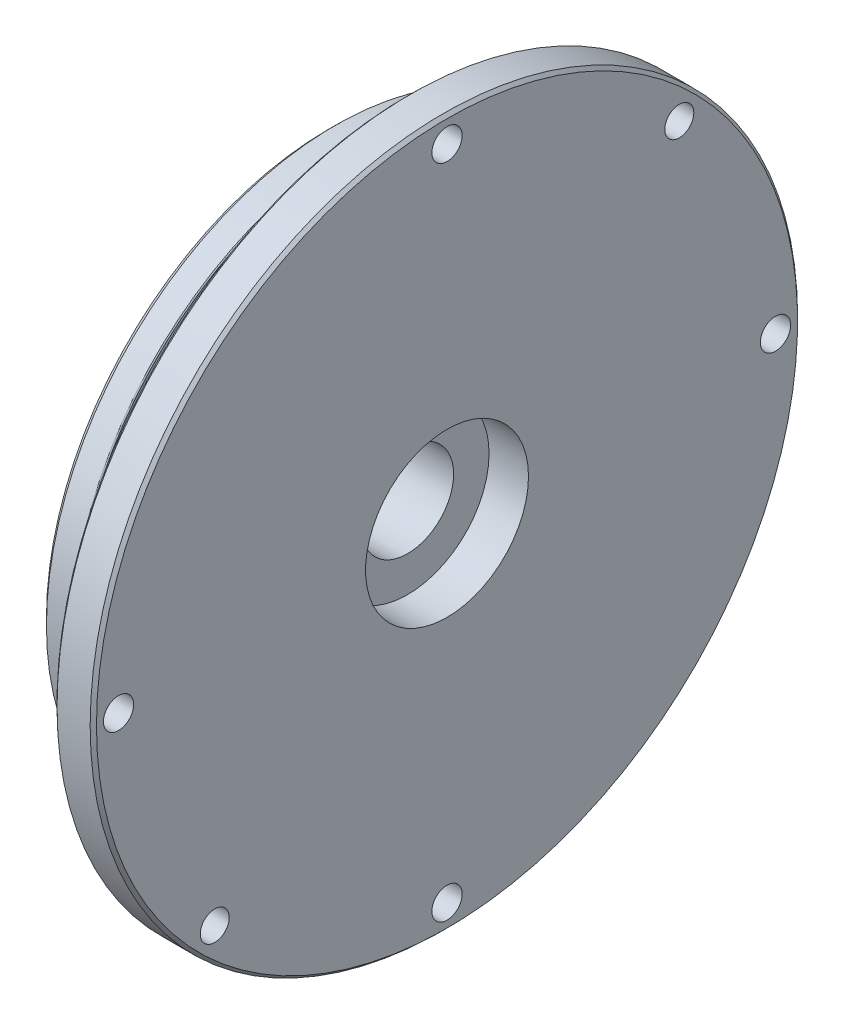
ISO-10303-21;
HEADER;
FILE_DESCRIPTION(('STEP AP214'),'2;1');
FILE_NAME('part.step','',(''),(''),'','','');
FILE_SCHEMA(('AUTOMOTIVE_DESIGN { 1 0 10303 214 1 1 1 1 }'));
ENDSEC;
DATA;
#1=APPLICATION_CONTEXT('core data for automotive mechanical design processes');
#2=APPLICATION_PROTOCOL_DEFINITION('international standard','automotive_design',2000,#1);
#3=PRODUCT_CONTEXT('',#1,'mechanical');
#4=PRODUCT('Part','Part','',(#3));
#5=PRODUCT_RELATED_PRODUCT_CATEGORY('part','',(#4));
#6=PRODUCT_DEFINITION_FORMATION('','',#4);
#7=PRODUCT_DEFINITION_CONTEXT('part definition',#1,'design');
#8=PRODUCT_DEFINITION('design','',#6,#7);
#9=PRODUCT_DEFINITION_SHAPE('','',#8);
#10=(LENGTH_UNIT() NAMED_UNIT(*) SI_UNIT(.MILLI.,.METRE.));
#11=(NAMED_UNIT(*) PLANE_ANGLE_UNIT() SI_UNIT($,.RADIAN.));
#12=(NAMED_UNIT(*) SI_UNIT($,.STERADIAN.) SOLID_ANGLE_UNIT());
#13=UNCERTAINTY_MEASURE_WITH_UNIT(LENGTH_MEASURE(1.E-05),#10,'distance_accuracy_value','');
#14=(GEOMETRIC_REPRESENTATION_CONTEXT(3) GLOBAL_UNCERTAINTY_ASSIGNED_CONTEXT((#13)) GLOBAL_UNIT_ASSIGNED_CONTEXT((#10,
#11,#12)) REPRESENTATION_CONTEXT('',''));
#15=CARTESIAN_POINT('',(0.,0.,0.));
#16=DIRECTION('',(0.,0.,1.));
#17=DIRECTION('',(1.,0.,0.));
#18=AXIS2_PLACEMENT_3D('',#15,#16,#17);
#19=CARTESIAN_POINT('',(3.937,0.,34.8996));
#20=DIRECTION('',(1.,0.,0.));
#21=DIRECTION('',(0.,0.,-1.));
#22=AXIS2_PLACEMENT_3D('',#19,#20,#21);
#23=PLANE('',#22);
#24=CARTESIAN_POINT('',(3.937,0.,0.));
#25=DIRECTION('',(1.,0.,0.));
#26=DIRECTION('',(0.,0.,1.));
#27=AXIS2_PLACEMENT_3D('',#24,#25,#26);
#28=CIRCLE('',#27,34.036);
#29=CARTESIAN_POINT('',(3.937,0.,-34.036));
#30=VERTEX_POINT('',#29);
#31=CARTESIAN_POINT('',(3.937,0.,34.036));
#32=VERTEX_POINT('',#31);
#33=EDGE_CURVE('E60',#30,#32,#28,.F.);
#34=ORIENTED_EDGE('',*,*,#33,.T.);
#35=CARTESIAN_POINT('',(3.937,0.,0.));
#36=DIRECTION('',(1.,0.,0.));
#37=DIRECTION('',(0.,0.,-1.));
#38=AXIS2_PLACEMENT_3D('',#35,#36,#37);
#39=CIRCLE('',#38,34.036);
#40=EDGE_CURVE('E63',#32,#30,#39,.F.);
#41=ORIENTED_EDGE('',*,*,#40,.T.);
#42=EDGE_LOOP('',(#34,#41));
#43=FACE_BOUND('',#42,.T.);
#44=CARTESIAN_POINT('',(3.937,0.,0.));
#45=DIRECTION('',(-1.,0.,0.));
#46=DIRECTION('',(0.,0.,1.));
#47=AXIS2_PLACEMENT_3D('',#44,#45,#46);
#48=CIRCLE('',#47,34.7726);
#49=CARTESIAN_POINT('',(3.937,0.,34.7726));
#50=VERTEX_POINT('',#49);
#51=CARTESIAN_POINT('',(3.937,0.,-34.7726));
#52=VERTEX_POINT('',#51);
#53=EDGE_CURVE('E107',#50,#52,#48,.T.);
#54=ORIENTED_EDGE('',*,*,#53,.F.);
#55=CARTESIAN_POINT('',(3.937,0.,0.));
#56=DIRECTION('',(-1.,0.,0.));
#57=DIRECTION('',(0.,0.,-1.));
#58=AXIS2_PLACEMENT_3D('',#55,#56,#57);
#59=CIRCLE('',#58,34.7726);
#60=EDGE_CURVE('E69',#52,#50,#59,.T.);
#61=ORIENTED_EDGE('',*,*,#60,.F.);
#62=EDGE_LOOP('',(#54,#61));
#63=FACE_BOUND('',#62,.T.);
#64=ADVANCED_FACE('F19',(#43,#63),#23,.T.);
#65=CARTESIAN_POINT('',(4.318,0.,0.));
#66=DIRECTION('',(1.,0.,0.));
#67=DIRECTION('',(0.,0.,-1.));
#68=AXIS2_PLACEMENT_3D('',#65,#66,#67);
#69=TOROIDAL_SURFACE('',#68,34.036,0.381);
#70=CARTESIAN_POINT('',(4.318,0.,0.));
#71=DIRECTION('',(-1.,0.,0.));
#72=DIRECTION('',(0.,0.,1.));
#73=AXIS2_PLACEMENT_3D('',#70,#71,#72);
#74=CIRCLE('',#73,33.655);
#75=CARTESIAN_POINT('',(4.318,0.,33.655));
#76=VERTEX_POINT('',#75);
#77=EDGE_CURVE('E104',#76,#76,#74,.F.);
#78=ORIENTED_EDGE('',*,*,#77,.F.);
#79=EDGE_LOOP('',(#78));
#80=FACE_BOUND('',#79,.T.);
#81=ORIENTED_EDGE('',*,*,#33,.F.);
#82=ORIENTED_EDGE('',*,*,#40,.F.);
#83=EDGE_LOOP('',(#81,#82));
#84=FACE_BOUND('',#83,.T.);
#85=ADVANCED_FACE('F72',(#80,#84),#69,.F.);
#86=CARTESIAN_POINT('',(3.81,0.,0.));
#87=DIRECTION('',(1.,0.,0.));
#88=DIRECTION('',(0.,0.,-1.));
#89=AXIS2_PLACEMENT_3D('',#86,#87,#88);
#90=TOROIDAL_SURFACE('',#89,34.7726,0.127);
#91=ORIENTED_EDGE('',*,*,#60,.T.);
#92=ORIENTED_EDGE('',*,*,#53,.T.);
#93=EDGE_LOOP('',(#91,#92));
#94=FACE_BOUND('',#93,.T.);
#95=CARTESIAN_POINT('',(3.81,0.,0.));
#96=DIRECTION('',(-1.,0.,0.));
#97=DIRECTION('',(0.,0.,1.));
#98=AXIS2_PLACEMENT_3D('',#95,#96,#97);
#99=CIRCLE('',#98,34.8996);
#100=CARTESIAN_POINT('',(3.81,0.,34.8996));
#101=VERTEX_POINT('',#100);
#102=EDGE_CURVE('E101',#101,#101,#99,.T.);
#103=ORIENTED_EDGE('',*,*,#102,.F.);
#104=EDGE_LOOP('',(#103));
#105=FACE_BOUND('',#104,.T.);
#106=ADVANCED_FACE('F81',(#94,#105),#90,.T.);
#107=CARTESIAN_POINT('',(0.,0.,0.));
#108=DIRECTION('',(-1.,0.,0.));
#109=DIRECTION('',(0.,0.,1.));
#110=AXIS2_PLACEMENT_3D('',#107,#108,#109);
#111=CYLINDRICAL_SURFACE('',#110,33.655);
#112=ORIENTED_EDGE('',*,*,#77,.T.);
#113=EDGE_LOOP('',(#112));
#114=FACE_BOUND('',#113,.T.);
#115=CARTESIAN_POINT('',(5.96899999999999,0.,0.));
#116=DIRECTION('',(-1.,0.,0.));
#117=DIRECTION('',(0.,0.,1.));
#118=AXIS2_PLACEMENT_3D('',#115,#116,#117);
#119=CIRCLE('',#118,33.655);
#120=CARTESIAN_POINT('',(5.96899999999999,0.,33.655));
#121=VERTEX_POINT('',#120);
#122=EDGE_CURVE('E587',#121,#121,#119,.T.);
#123=ORIENTED_EDGE('',*,*,#122,.T.);
#124=EDGE_LOOP('',(#123));
#125=FACE_BOUND('',#124,.T.);
#126=ADVANCED_FACE('F91',(#114,#125),#111,.T.);
#127=CARTESIAN_POINT('',(0.,0.,0.));
#128=DIRECTION('',(-1.,0.,0.));
#129=DIRECTION('',(0.,0.,1.));
#130=AXIS2_PLACEMENT_3D('',#127,#128,#129);
#131=CYLINDRICAL_SURFACE('',#130,34.8996);
#132=CARTESIAN_POINT('',(0.787400000000008,0.,0.));
#133=DIRECTION('',(1.,0.,0.));
#134=DIRECTION('',(0.,0.,-1.));
#135=AXIS2_PLACEMENT_3D('',#132,#133,#134);
#136=CIRCLE('',#135,34.8996);
#137=CARTESIAN_POINT('',(0.787400000000009,0.,-34.8996));
#138=VERTEX_POINT('',#137);
#139=EDGE_CURVE('E585',#138,#138,#136,.F.);
#140=ORIENTED_EDGE('',*,*,#139,.F.);
#141=EDGE_LOOP('',(#140));
#142=FACE_BOUND('',#141,.T.);
#143=ORIENTED_EDGE('',*,*,#102,.T.);
#144=EDGE_LOOP('',(#143));
#145=FACE_BOUND('',#144,.T.);
#146=ADVANCED_FACE('F404',(#142,#145),#131,.T.);
#147=CARTESIAN_POINT('',(5.96899999999999,0.,0.));
#148=DIRECTION('',(-1.,0.,0.));
#149=DIRECTION('',(0.,0.,1.));
#150=AXIS2_PLACEMENT_3D('',#147,#148,#149);
#151=TOROIDAL_SURFACE('',#150,34.036,0.381);
#152=ORIENTED_EDGE('',*,*,#122,.F.);
#153=EDGE_LOOP('',(#152));
#154=FACE_BOUND('',#153,.T.);
#155=CARTESIAN_POINT('',(6.35,0.,0.));
#156=DIRECTION('',(-1.,0.,0.));
#157=DIRECTION('',(0.,0.,-1.));
#158=AXIS2_PLACEMENT_3D('',#155,#156,#157);
#159=CIRCLE('',#158,34.036);
#160=CARTESIAN_POINT('',(6.35,0.,34.036));
#161=VERTEX_POINT('',#160);
#162=CARTESIAN_POINT('',(6.35,0.,-34.036));
#163=VERTEX_POINT('',#162);
#164=EDGE_CURVE('E201',#161,#163,#159,.F.);
#165=ORIENTED_EDGE('',*,*,#164,.F.);
#166=CARTESIAN_POINT('',(6.35,0.,0.));
#167=DIRECTION('',(-1.,0.,0.));
#168=DIRECTION('',(0.,0.,1.));
#169=AXIS2_PLACEMENT_3D('',#166,#167,#168);
#170=CIRCLE('',#169,34.036);
#171=EDGE_CURVE('E196',#163,#161,#170,.F.);
#172=ORIENTED_EDGE('',*,*,#171,.F.);
#173=EDGE_LOOP('',(#165,#172));
#174=FACE_BOUND('',#173,.T.);
#175=ADVANCED_FACE('F399',(#154,#174),#151,.F.);
#176=CARTESIAN_POINT('',(0.78740000000001,0.,0.));
#177=DIRECTION('',(1.,0.,0.));
#178=DIRECTION('',(0.,0.,-1.));
#179=AXIS2_PLACEMENT_3D('',#176,#177,#178);
#180=CONICAL_SURFACE('',#179,34.8996,0.785398163397448);
#181=ORIENTED_EDGE('',*,*,#139,.T.);
#182=EDGE_LOOP('',(#181));
#183=FACE_BOUND('',#182,.T.);
#184=CARTESIAN_POINT('',(0.,0.,0.));
#185=DIRECTION('',(1.,0.,0.));
#186=DIRECTION('',(0.,0.,-1.));
#187=AXIS2_PLACEMENT_3D('',#184,#185,#186);
#188=CIRCLE('',#187,34.1122);
#189=CARTESIAN_POINT('',(0.,0.,-34.1122));
#190=VERTEX_POINT('',#189);
#191=EDGE_CURVE('E193',#190,#190,#188,.F.);
#192=ORIENTED_EDGE('',*,*,#191,.F.);
#193=EDGE_LOOP('',(#192));
#194=FACE_BOUND('',#193,.T.);
#195=ADVANCED_FACE('F163',(#183,#194),#180,.T.);
#196=CARTESIAN_POINT('',(6.35,0.,33.655));
#197=DIRECTION('',(-1.,0.,0.));
#198=DIRECTION('',(0.,0.,1.));
#199=AXIS2_PLACEMENT_3D('',#196,#197,#198);
#200=PLANE('',#199);
#201=ORIENTED_EDGE('',*,*,#164,.T.);
#202=ORIENTED_EDGE('',*,*,#171,.T.);
#203=EDGE_LOOP('',(#201,#202));
#204=FACE_BOUND('',#203,.T.);
#205=CARTESIAN_POINT('',(6.35,0.,0.));
#206=DIRECTION('',(1.,0.,0.));
#207=DIRECTION('',(0.,0.,-1.));
#208=AXIS2_PLACEMENT_3D('',#205,#206,#207);
#209=CIRCLE('',#208,34.7726);
#210=CARTESIAN_POINT('',(6.35,0.,-34.7726));
#211=VERTEX_POINT('',#210);
#212=CARTESIAN_POINT('',(6.35,0.,34.7726));
#213=VERTEX_POINT('',#212);
#214=EDGE_CURVE('E39',#211,#213,#209,.T.);
#215=ORIENTED_EDGE('',*,*,#214,.F.);
#216=CARTESIAN_POINT('',(6.35,0.,0.));
#217=DIRECTION('',(1.,0.,0.));
#218=DIRECTION('',(0.,0.,1.));
#219=AXIS2_PLACEMENT_3D('',#216,#217,#218);
#220=CIRCLE('',#219,34.7726);
#221=EDGE_CURVE('E183',#213,#211,#220,.T.);
#222=ORIENTED_EDGE('',*,*,#221,.F.);
#223=EDGE_LOOP('',(#215,#222));
#224=FACE_BOUND('',#223,.T.);
#225=ADVANCED_FACE('F152',(#204,#224),#200,.T.);
#226=CARTESIAN_POINT('',(0.,0.,0.));
#227=DIRECTION('',(-1.,0.,0.));
#228=DIRECTION('',(0.,0.,1.));
#229=AXIS2_PLACEMENT_3D('',#226,#227,#228);
#230=PLANE('',#229);
#231=ORIENTED_EDGE('',*,*,#191,.T.);
#232=EDGE_LOOP('',(#231));
#233=FACE_BOUND('',#232,.T.);
#234=CARTESIAN_POINT('',(0.,0.,0.));
#235=DIRECTION('',(1.,0.,0.));
#236=DIRECTION('',(0.,0.,-1.));
#237=AXIS2_PLACEMENT_3D('',#234,#235,#236);
#238=CIRCLE('',#237,5.55625);
#239=CARTESIAN_POINT('',(0.,0.,-5.55625));
#240=VERTEX_POINT('',#239);
#241=EDGE_CURVE('E186',#240,#240,#238,.T.);
#242=ORIENTED_EDGE('',*,*,#241,.T.);
#243=EDGE_LOOP('',(#242));
#244=FACE_BOUND('',#243,.T.);
#245=ADVANCED_FACE('F162',(#233,#244),#230,.T.);
#246=CARTESIAN_POINT('',(6.477,0.,0.));
#247=DIRECTION('',(-1.,0.,0.));
#248=DIRECTION('',(0.,0.,1.));
#249=AXIS2_PLACEMENT_3D('',#246,#247,#248);
#250=TOROIDAL_SURFACE('',#249,34.7726,0.127);
#251=CARTESIAN_POINT('',(6.477,0.,0.));
#252=DIRECTION('',(-1.,0.,0.));
#253=DIRECTION('',(0.,0.,1.));
#254=AXIS2_PLACEMENT_3D('',#251,#252,#253);
#255=CIRCLE('',#254,34.8996);
#256=CARTESIAN_POINT('',(6.477,0.,34.8996));
#257=VERTEX_POINT('',#256);
#258=EDGE_CURVE('E191',#257,#257,#255,.F.);
#259=ORIENTED_EDGE('',*,*,#258,.F.);
#260=EDGE_LOOP('',(#259));
#261=FACE_BOUND('',#260,.T.);
#262=ORIENTED_EDGE('',*,*,#221,.T.);
#263=ORIENTED_EDGE('',*,*,#214,.T.);
#264=EDGE_LOOP('',(#262,#263));
#265=FACE_BOUND('',#264,.T.);
#266=ADVANCED_FACE('F209',(#261,#265),#250,.T.);
#267=CARTESIAN_POINT('',(9.525,0.,0.));
#268=DIRECTION('',(1.,0.,0.));
#269=DIRECTION('',(0.,0.,-1.));
#270=AXIS2_PLACEMENT_3D('',#267,#268,#269);
#271=CYLINDRICAL_SURFACE('',#270,5.55625);
#272=CARTESIAN_POINT('',(9.525,0.,0.));
#273=DIRECTION('',(1.,0.,0.));
#274=DIRECTION('',(0.,0.,-1.));
#275=AXIS2_PLACEMENT_3D('',#272,#273,#274);
#276=CIRCLE('',#275,5.55625);
#277=CARTESIAN_POINT('',(9.525,0.,-5.55625));
#278=VERTEX_POINT('',#277);
#279=EDGE_CURVE('E230',#278,#278,#276,.F.);
#280=ORIENTED_EDGE('',*,*,#279,.F.);
#281=EDGE_LOOP('',(#280));
#282=FACE_BOUND('',#281,.T.);
#283=ORIENTED_EDGE('',*,*,#241,.F.);
#284=EDGE_LOOP('',(#283));
#285=FACE_BOUND('',#284,.T.);
#286=ADVANCED_FACE('F219',(#282,#285),#271,.F.);
#287=CARTESIAN_POINT('',(0.,0.,0.));
#288=DIRECTION('',(-1.,0.,0.));
#289=DIRECTION('',(0.,0.,1.));
#290=AXIS2_PLACEMENT_3D('',#287,#288,#289);
#291=CYLINDRICAL_SURFACE('',#290,34.8996);
#292=CARTESIAN_POINT('',(9.525,0.,0.));
#293=DIRECTION('',(-1.,0.,0.));
#294=DIRECTION('',(0.,0.,1.));
#295=AXIS2_PLACEMENT_3D('',#292,#293,#294);
#296=CIRCLE('',#295,34.8996);
#297=CARTESIAN_POINT('',(9.525,0.,34.8996));
#298=VERTEX_POINT('',#297);
#299=EDGE_CURVE('E240',#298,#298,#296,.F.);
#300=ORIENTED_EDGE('',*,*,#299,.F.);
#301=EDGE_LOOP('',(#300));
#302=FACE_BOUND('',#301,.T.);
#303=ORIENTED_EDGE('',*,*,#258,.T.);
#304=EDGE_LOOP('',(#303));
#305=FACE_BOUND('',#304,.T.);
#306=ADVANCED_FACE('F367',(#302,#305),#291,.T.);
#307=CARTESIAN_POINT('',(9.90599999999997,0.,0.));
#308=DIRECTION('',(1.,0.,0.));
#309=DIRECTION('',(0.,0.,-1.));
#310=AXIS2_PLACEMENT_3D('',#307,#308,#309);
#311=CONICAL_SURFACE('',#310,42.7355,0.785398163397469);
#312=CARTESIAN_POINT('',(9.90599999999997,0.,0.));
#313=DIRECTION('',(-1.,0.,0.));
#314=DIRECTION('',(0.,0.,1.));
#315=AXIS2_PLACEMENT_3D('',#312,#313,#314);
#316=CIRCLE('',#315,42.7355);
#317=CARTESIAN_POINT('',(9.90599999999997,0.,42.7355));
#318=VERTEX_POINT('',#317);
#319=EDGE_CURVE('E226',#318,#318,#316,.F.);
#320=ORIENTED_EDGE('',*,*,#319,.F.);
#321=EDGE_LOOP('',(#320));
#322=FACE_BOUND('',#321,.T.);
#323=CARTESIAN_POINT('',(9.525,0.,0.));
#324=DIRECTION('',(1.,0.,0.));
#325=DIRECTION('',(0.,0.,-1.));
#326=AXIS2_PLACEMENT_3D('',#323,#324,#325);
#327=CIRCLE('',#326,42.3545);
#328=CARTESIAN_POINT('',(9.525,0.,-42.3545));
#329=VERTEX_POINT('',#328);
#330=EDGE_CURVE('E235',#329,#329,#327,.F.);
#331=ORIENTED_EDGE('',*,*,#330,.F.);
#332=EDGE_LOOP('',(#331));
#333=FACE_BOUND('',#332,.T.);
#334=ADVANCED_FACE('F361',(#322,#333),#311,.T.);
#335=CARTESIAN_POINT('',(9.525,0.,0.));
#336=DIRECTION('',(1.,0.,0.));
#337=DIRECTION('',(0.,0.,-1.));
#338=AXIS2_PLACEMENT_3D('',#335,#336,#337);
#339=PLANE('',#338);
#340=CARTESIAN_POINT('',(9.525,0.,0.));
#341=DIRECTION('',(1.,0.,0.));
#342=DIRECTION('',(0.,0.,-1.));
#343=AXIS2_PLACEMENT_3D('',#340,#341,#342);
#344=CIRCLE('',#343,9.8425);
#345=CARTESIAN_POINT('',(9.525,0.,-9.8425));
#346=VERTEX_POINT('',#345);
#347=EDGE_CURVE('E246',#346,#346,#344,.T.);
#348=ORIENTED_EDGE('',*,*,#347,.T.);
#349=EDGE_LOOP('',(#348));
#350=FACE_BOUND('',#349,.T.);
#351=ORIENTED_EDGE('',*,*,#279,.T.);
#352=EDGE_LOOP('',(#351));
#353=FACE_BOUND('',#352,.T.);
#354=ADVANCED_FACE('F352',(#350,#353),#339,.T.);
#355=CARTESIAN_POINT('',(9.525,0.,34.8996));
#356=DIRECTION('',(-1.,0.,0.));
#357=DIRECTION('',(0.,0.,1.));
#358=AXIS2_PLACEMENT_3D('',#355,#356,#357);
#359=PLANE('',#358);
#360=ORIENTED_EDGE('',*,*,#299,.T.);
#361=EDGE_LOOP('',(#360));
#362=FACE_BOUND('',#361,.T.);
#363=ORIENTED_EDGE('',*,*,#330,.T.);
#364=EDGE_LOOP('',(#363));
#365=FACE_BOUND('',#364,.T.);
#366=CARTESIAN_POINT('',(9.525,39.6875,0.));
#367=DIRECTION('',(1.,0.,0.));
#368=DIRECTION('',(0.,0.,-1.));
#369=AXIS2_PLACEMENT_3D('',#366,#367,#368);
#370=CIRCLE('',#369,1.8288);
#371=CARTESIAN_POINT('',(9.525,39.6875,-1.8288));
#372=VERTEX_POINT('',#371);
#373=EDGE_CURVE('E262',#372,#372,#370,.T.);
#374=ORIENTED_EDGE('',*,*,#373,.T.);
#375=EDGE_LOOP('',(#374));
#376=FACE_BOUND('',#375,.T.);
#377=CARTESIAN_POINT('',(9.525,-39.6875,0.));
#378=DIRECTION('',(1.,0.,0.));
#379=DIRECTION('',(0.,0.,-1.));
#380=AXIS2_PLACEMENT_3D('',#377,#378,#379);
#381=CIRCLE('',#380,1.8288);
#382=CARTESIAN_POINT('',(9.525,-39.6875,-1.8288));
#383=VERTEX_POINT('',#382);
#384=EDGE_CURVE('E268',#383,#383,#381,.T.);
#385=ORIENTED_EDGE('',*,*,#384,.T.);
#386=EDGE_LOOP('',(#385));
#387=FACE_BOUND('',#386,.T.);
#388=CARTESIAN_POINT('',(9.525,0.,-39.6875));
#389=DIRECTION('',(1.,0.,0.));
#390=DIRECTION('',(0.,0.,-1.));
#391=AXIS2_PLACEMENT_3D('',#388,#389,#390);
#392=CIRCLE('',#391,1.8288);
#393=CARTESIAN_POINT('',(9.525,0.,-41.5163));
#394=VERTEX_POINT('',#393);
#395=EDGE_CURVE('E275',#394,#394,#392,.T.);
#396=ORIENTED_EDGE('',*,*,#395,.T.);
#397=EDGE_LOOP('',(#396));
#398=FACE_BOUND('',#397,.T.);
#399=CARTESIAN_POINT('',(9.525,0.,39.6875));
#400=DIRECTION('',(1.,0.,0.));
#401=DIRECTION('',(0.,0.,-1.));
#402=AXIS2_PLACEMENT_3D('',#399,#400,#401);
#403=CIRCLE('',#402,1.8288);
#404=CARTESIAN_POINT('',(9.525,0.,37.8587));
#405=VERTEX_POINT('',#404);
#406=EDGE_CURVE('E280',#405,#405,#403,.T.);
#407=ORIENTED_EDGE('',*,*,#406,.T.);
#408=EDGE_LOOP('',(#407));
#409=FACE_BOUND('',#408,.T.);
#410=CARTESIAN_POINT('',(9.525,28.0633003783411,-28.0633003783411));
#411=DIRECTION('',(1.,0.,0.));
#412=DIRECTION('',(0.,0.,-1.));
#413=AXIS2_PLACEMENT_3D('',#410,#411,#412);
#414=CIRCLE('',#413,1.7526);
#415=CARTESIAN_POINT('',(9.525,28.0633003783411,-29.8159003783411));
#416=VERTEX_POINT('',#415);
#417=EDGE_CURVE('E285',#416,#416,#414,.T.);
#418=ORIENTED_EDGE('',*,*,#417,.T.);
#419=EDGE_LOOP('',(#418));
#420=FACE_BOUND('',#419,.T.);
#421=CARTESIAN_POINT('',(9.525,-28.0633003783411,28.0633003783412));
#422=DIRECTION('',(1.,0.,0.));
#423=DIRECTION('',(0.,0.,-1.));
#424=AXIS2_PLACEMENT_3D('',#421,#422,#423);
#425=CIRCLE('',#424,1.7526);
#426=CARTESIAN_POINT('',(9.525,-28.0633003783411,26.3107003783411));
#427=VERTEX_POINT('',#426);
#428=EDGE_CURVE('E251',#427,#427,#425,.T.);
#429=ORIENTED_EDGE('',*,*,#428,.T.);
#430=EDGE_LOOP('',(#429));
#431=FACE_BOUND('',#430,.T.);
#432=ADVANCED_FACE('F297',(#362,#365,#376,#387,#398,#409,#420,#431),#359,.T.);
#433=CARTESIAN_POINT('',(0.,0.,0.));
#434=DIRECTION('',(-1.,0.,0.));
#435=DIRECTION('',(0.,0.,1.));
#436=AXIS2_PLACEMENT_3D('',#433,#434,#435);
#437=CYLINDRICAL_SURFACE('',#436,42.7355);
#438=ORIENTED_EDGE('',*,*,#319,.T.);
#439=EDGE_LOOP('',(#438));
#440=FACE_BOUND('',#439,.T.);
#441=CARTESIAN_POINT('',(13.9065,0.,0.));
#442=DIRECTION('',(-1.,0.,0.));
#443=DIRECTION('',(0.,0.,1.));
#444=AXIS2_PLACEMENT_3D('',#441,#442,#443);
#445=CIRCLE('',#444,42.7355);
#446=CARTESIAN_POINT('',(13.9065,0.,42.7355));
#447=VERTEX_POINT('',#446);
#448=EDGE_CURVE('E267',#447,#447,#445,.F.);
#449=ORIENTED_EDGE('',*,*,#448,.F.);
#450=EDGE_LOOP('',(#449));
#451=FACE_BOUND('',#450,.T.);
#452=ADVANCED_FACE('F313',(#440,#451),#437,.T.);
#453=CARTESIAN_POINT('',(9.525,0.,0.));
#454=DIRECTION('',(1.,0.,0.));
#455=DIRECTION('',(0.,0.,-1.));
#456=AXIS2_PLACEMENT_3D('',#453,#454,#455);
#457=CYLINDRICAL_SURFACE('',#456,9.8425);
#458=CARTESIAN_POINT('',(14.2875,0.,0.));
#459=DIRECTION('',(1.,0.,0.));
#460=DIRECTION('',(0.,0.,-1.));
#461=AXIS2_PLACEMENT_3D('',#458,#459,#460);
#462=CIRCLE('',#461,9.8425);
#463=CARTESIAN_POINT('',(14.2875,0.,-9.8425));
#464=VERTEX_POINT('',#463);
#465=EDGE_CURVE('E269',#464,#464,#462,.F.);
#466=ORIENTED_EDGE('',*,*,#465,.F.);
#467=EDGE_LOOP('',(#466));
#468=FACE_BOUND('',#467,.T.);
#469=ORIENTED_EDGE('',*,*,#347,.F.);
#470=EDGE_LOOP('',(#469));
#471=FACE_BOUND('',#470,.T.);
#472=ADVANCED_FACE('F302',(#468,#471),#457,.F.);
#473=CARTESIAN_POINT('',(0.,-28.0633003783411,28.0633003783412));
#474=DIRECTION('',(1.,0.,0.));
#475=DIRECTION('',(0.,0.,-1.));
#476=AXIS2_PLACEMENT_3D('',#473,#474,#475);
#477=CYLINDRICAL_SURFACE('',#476,1.7526);
#478=CARTESIAN_POINT('',(14.2875,-28.0633003783411,28.0633003783412));
#479=DIRECTION('',(1.,0.,0.));
#480=DIRECTION('',(0.,0.,-1.));
#481=AXIS2_PLACEMENT_3D('',#478,#479,#480);
#482=CIRCLE('',#481,1.7526);
#483=CARTESIAN_POINT('',(14.2875,-28.0633003783411,26.3107003783411));
#484=VERTEX_POINT('',#483);
#485=EDGE_CURVE('E677',#484,#484,#482,.F.);
#486=ORIENTED_EDGE('',*,*,#485,.F.);
#487=EDGE_LOOP('',(#486));
#488=FACE_BOUND('',#487,.T.);
#489=ORIENTED_EDGE('',*,*,#428,.F.);
#490=EDGE_LOOP('',(#489));
#491=FACE_BOUND('',#490,.T.);
#492=ADVANCED_FACE('F299',(#488,#491),#477,.F.);
#493=CARTESIAN_POINT('',(0.,28.0633003783411,-28.0633003783411));
#494=DIRECTION('',(1.,0.,0.));
#495=DIRECTION('',(0.,0.,-1.));
#496=AXIS2_PLACEMENT_3D('',#493,#494,#495);
#497=CYLINDRICAL_SURFACE('',#496,1.7526);
#498=CARTESIAN_POINT('',(14.2875,28.0633003783411,-28.0633003783411));
#499=DIRECTION('',(1.,0.,0.));
#500=DIRECTION('',(0.,0.,-1.));
#501=AXIS2_PLACEMENT_3D('',#498,#499,#500);
#502=CIRCLE('',#501,1.7526);
#503=CARTESIAN_POINT('',(14.2875,28.0633003783411,-29.8159003783411));
#504=VERTEX_POINT('',#503);
#505=EDGE_CURVE('E674',#504,#504,#502,.F.);
#506=ORIENTED_EDGE('',*,*,#505,.F.);
#507=EDGE_LOOP('',(#506));
#508=FACE_BOUND('',#507,.T.);
#509=ORIENTED_EDGE('',*,*,#417,.F.);
#510=EDGE_LOOP('',(#509));
#511=FACE_BOUND('',#510,.T.);
#512=ADVANCED_FACE('F301',(#508,#511),#497,.F.);
#513=CARTESIAN_POINT('',(0.,0.,39.6875));
#514=DIRECTION('',(1.,0.,0.));
#515=DIRECTION('',(0.,0.,-1.));
#516=AXIS2_PLACEMENT_3D('',#513,#514,#515);
#517=CYLINDRICAL_SURFACE('',#516,1.8288);
#518=CARTESIAN_POINT('',(14.2875,0.,39.6875));
#519=DIRECTION('',(1.,0.,0.));
#520=DIRECTION('',(0.,0.,-1.));
#521=AXIS2_PLACEMENT_3D('',#518,#519,#520);
#522=CIRCLE('',#521,1.8288);
#523=CARTESIAN_POINT('',(14.2875,0.,37.8587));
#524=VERTEX_POINT('',#523);
#525=EDGE_CURVE('E348',#524,#524,#522,.F.);
#526=ORIENTED_EDGE('',*,*,#525,.F.);
#527=EDGE_LOOP('',(#526));
#528=FACE_BOUND('',#527,.T.);
#529=ORIENTED_EDGE('',*,*,#406,.F.);
#530=EDGE_LOOP('',(#529));
#531=FACE_BOUND('',#530,.T.);
#532=ADVANCED_FACE('F310',(#528,#531),#517,.F.);
#533=CARTESIAN_POINT('',(0.,0.,-39.6875));
#534=DIRECTION('',(1.,0.,0.));
#535=DIRECTION('',(0.,0.,-1.));
#536=AXIS2_PLACEMENT_3D('',#533,#534,#535);
#537=CYLINDRICAL_SURFACE('',#536,1.8288);
#538=CARTESIAN_POINT('',(14.2875,0.,-39.6875));
#539=DIRECTION('',(1.,0.,0.));
#540=DIRECTION('',(0.,0.,-1.));
#541=AXIS2_PLACEMENT_3D('',#538,#539,#540);
#542=CIRCLE('',#541,1.8288);
#543=CARTESIAN_POINT('',(14.2875,0.,-41.5163));
#544=VERTEX_POINT('',#543);
#545=EDGE_CURVE('E668',#544,#544,#542,.F.);
#546=ORIENTED_EDGE('',*,*,#545,.F.);
#547=EDGE_LOOP('',(#546));
#548=FACE_BOUND('',#547,.T.);
#549=ORIENTED_EDGE('',*,*,#395,.F.);
#550=EDGE_LOOP('',(#549));
#551=FACE_BOUND('',#550,.T.);
#552=ADVANCED_FACE('F336',(#548,#551),#537,.F.);
#553=CARTESIAN_POINT('',(0.,-39.6875,0.));
#554=DIRECTION('',(1.,0.,0.));
#555=DIRECTION('',(0.,0.,-1.));
#556=AXIS2_PLACEMENT_3D('',#553,#554,#555);
#557=CYLINDRICAL_SURFACE('',#556,1.8288);
#558=CARTESIAN_POINT('',(14.2875,-39.6875,0.));
#559=DIRECTION('',(1.,0.,0.));
#560=DIRECTION('',(0.,0.,-1.));
#561=AXIS2_PLACEMENT_3D('',#558,#559,#560);
#562=CIRCLE('',#561,1.8288);
#563=CARTESIAN_POINT('',(14.2875,-39.6875,-1.8288));
#564=VERTEX_POINT('',#563);
#565=EDGE_CURVE('E664',#564,#564,#562,.F.);
#566=ORIENTED_EDGE('',*,*,#565,.F.);
#567=EDGE_LOOP('',(#566));
#568=FACE_BOUND('',#567,.T.);
#569=ORIENTED_EDGE('',*,*,#384,.F.);
#570=EDGE_LOOP('',(#569));
#571=FACE_BOUND('',#570,.T.);
#572=ADVANCED_FACE('F332',(#568,#571),#557,.F.);
#573=CARTESIAN_POINT('',(0.,39.6875,0.));
#574=DIRECTION('',(1.,0.,0.));
#575=DIRECTION('',(0.,0.,-1.));
#576=AXIS2_PLACEMENT_3D('',#573,#574,#575);
#577=CYLINDRICAL_SURFACE('',#576,1.8288);
#578=CARTESIAN_POINT('',(14.2875,39.6875,0.));
#579=DIRECTION('',(1.,0.,0.));
#580=DIRECTION('',(0.,0.,-1.));
#581=AXIS2_PLACEMENT_3D('',#578,#579,#580);
#582=CIRCLE('',#581,1.8288);
#583=CARTESIAN_POINT('',(14.2875,39.6875,-1.8288));
#584=VERTEX_POINT('',#583);
#585=EDGE_CURVE('E31',#584,#584,#582,.F.);
#586=ORIENTED_EDGE('',*,*,#585,.F.);
#587=EDGE_LOOP('',(#586));
#588=FACE_BOUND('',#587,.T.);
#589=ORIENTED_EDGE('',*,*,#373,.F.);
#590=EDGE_LOOP('',(#589));
#591=FACE_BOUND('',#590,.T.);
#592=ADVANCED_FACE('F325',(#588,#591),#577,.F.);
#593=CARTESIAN_POINT('',(13.9065,0.,0.));
#594=DIRECTION('',(-1.,0.,0.));
#595=DIRECTION('',(0.,0.,1.));
#596=AXIS2_PLACEMENT_3D('',#593,#594,#595);
#597=CONICAL_SURFACE('',#596,42.7355,0.785398163397457);
#598=ORIENTED_EDGE('',*,*,#448,.T.);
#599=EDGE_LOOP('',(#598));
#600=FACE_BOUND('',#599,.T.);
#601=CARTESIAN_POINT('',(14.2875,0.,0.));
#602=DIRECTION('',(-1.,0.,0.));
#603=DIRECTION('',(0.,0.,1.));
#604=AXIS2_PLACEMENT_3D('',#601,#602,#603);
#605=CIRCLE('',#604,42.3545);
#606=CARTESIAN_POINT('',(14.2875,0.,42.3545));
#607=VERTEX_POINT('',#606);
#608=EDGE_CURVE('E12',#607,#607,#605,.F.);
#609=ORIENTED_EDGE('',*,*,#608,.F.);
#610=EDGE_LOOP('',(#609));
#611=FACE_BOUND('',#610,.T.);
#612=ADVANCED_FACE('F319',(#600,#611),#597,.T.);
#613=CARTESIAN_POINT('',(14.2875,0.,42.7355));
#614=DIRECTION('',(1.,0.,0.));
#615=DIRECTION('',(0.,0.,-1.));
#616=AXIS2_PLACEMENT_3D('',#613,#614,#615);
#617=PLANE('',#616);
#618=ORIENTED_EDGE('',*,*,#608,.T.);
#619=EDGE_LOOP('',(#618));
#620=FACE_BOUND('',#619,.T.);
#621=ORIENTED_EDGE('',*,*,#585,.T.);
#622=EDGE_LOOP('',(#621));
#623=FACE_BOUND('',#622,.T.);
#624=ORIENTED_EDGE('',*,*,#565,.T.);
#625=EDGE_LOOP('',(#624));
#626=FACE_BOUND('',#625,.T.);
#627=ORIENTED_EDGE('',*,*,#545,.T.);
#628=EDGE_LOOP('',(#627));
#629=FACE_BOUND('',#628,.T.);
#630=ORIENTED_EDGE('',*,*,#525,.T.);
#631=EDGE_LOOP('',(#630));
#632=FACE_BOUND('',#631,.T.);
#633=ORIENTED_EDGE('',*,*,#505,.T.);
#634=EDGE_LOOP('',(#633));
#635=FACE_BOUND('',#634,.T.);
#636=ORIENTED_EDGE('',*,*,#485,.T.);
#637=EDGE_LOOP('',(#636));
#638=FACE_BOUND('',#637,.T.);
#639=ORIENTED_EDGE('',*,*,#465,.T.);
#640=EDGE_LOOP('',(#639));
#641=FACE_BOUND('',#640,.T.);
#642=ADVANCED_FACE('F317',(#620,#623,#626,#629,#632,#635,#638,#641),#617,.T.);
#643=CLOSED_SHELL('',(#64,#85,#106,#126,#146,#175,#195,#225,#245,#266,#286,#306,#334,#354,#432,
#452,#472,#492,#512,#532,#552,#572,#592,#612,#642));
#644=MANIFOLD_SOLID_BREP('B1',#643);
#645=ADVANCED_BREP_SHAPE_REPRESENTATION('',(#18,#644),#14);
#646=SHAPE_DEFINITION_REPRESENTATION(#9,#645);
ENDSEC;
END-ISO-10303-21;
